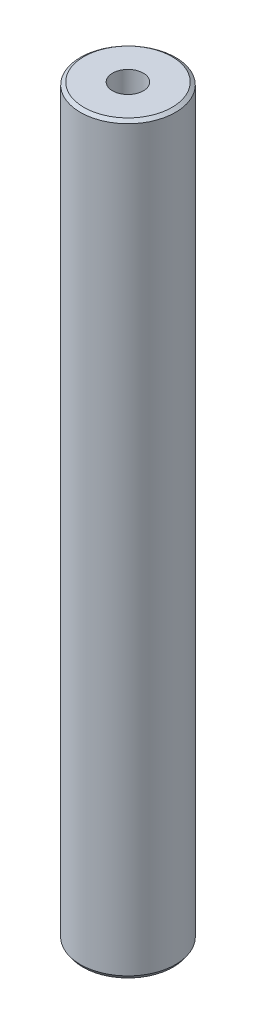
ISO-10303-21;
HEADER;
FILE_DESCRIPTION(('STEP AP214'),'2;1');
FILE_NAME('part.step','',(''),(''),'','','');
FILE_SCHEMA(('AUTOMOTIVE_DESIGN { 1 0 10303 214 1 1 1 1 }'));
ENDSEC;
DATA;
#1=APPLICATION_CONTEXT('core data for automotive mechanical design processes');
#2=APPLICATION_PROTOCOL_DEFINITION('international standard','automotive_design',2000,#1);
#3=PRODUCT_CONTEXT('',#1,'mechanical');
#4=PRODUCT('Part','Part','',(#3));
#5=PRODUCT_RELATED_PRODUCT_CATEGORY('part','',(#4));
#6=PRODUCT_DEFINITION_FORMATION('','',#4);
#7=PRODUCT_DEFINITION_CONTEXT('part definition',#1,'design');
#8=PRODUCT_DEFINITION('design','',#6,#7);
#9=PRODUCT_DEFINITION_SHAPE('','',#8);
#10=(LENGTH_UNIT() NAMED_UNIT(*) SI_UNIT(.MILLI.,.METRE.));
#11=(NAMED_UNIT(*) PLANE_ANGLE_UNIT() SI_UNIT($,.RADIAN.));
#12=(NAMED_UNIT(*) SI_UNIT($,.STERADIAN.) SOLID_ANGLE_UNIT());
#13=UNCERTAINTY_MEASURE_WITH_UNIT(LENGTH_MEASURE(1.E-05),#10,'distance_accuracy_value','');
#14=(GEOMETRIC_REPRESENTATION_CONTEXT(3) GLOBAL_UNCERTAINTY_ASSIGNED_CONTEXT((#13)) GLOBAL_UNIT_ASSIGNED_CONTEXT((#10,
#11,#12)) REPRESENTATION_CONTEXT('',''));
#15=CARTESIAN_POINT('',(0.,0.,0.));
#16=DIRECTION('',(0.,0.,1.));
#17=DIRECTION('',(1.,0.,0.));
#18=AXIS2_PLACEMENT_3D('',#15,#16,#17);
#19=CARTESIAN_POINT('',(0.,546.982576239871,0.));
#20=DIRECTION('',(0.,-1.,0.));
#21=DIRECTION('',(0.,0.,-1.));
#22=AXIS2_PLACEMENT_3D('',#19,#20,#21);
#23=CYLINDRICAL_SURFACE('',#22,35.);
#24=CARTESIAN_POINT('',(0.,545.144864558155,0.));
#25=DIRECTION('',(0.,1.,0.));
#26=DIRECTION('',(0.,0.,1.));
#27=AXIS2_PLACEMENT_3D('',#24,#25,#26);
#28=CIRCLE('',#27,35.);
#29=CARTESIAN_POINT('',(0.,545.144864558155,35.));
#30=VERTEX_POINT('',#29);
#31=EDGE_CURVE('E50',#30,#30,#28,.F.);
#32=ORIENTED_EDGE('',*,*,#31,.T.);
#33=EDGE_LOOP('',(#32));
#34=FACE_BOUND('',#33,.T.);
#35=CARTESIAN_POINT('',(0.,2.62993611991058,0.));
#36=DIRECTION('',(0.,1.,0.));
#37=DIRECTION('',(0.,0.,1.));
#38=AXIS2_PLACEMENT_3D('',#35,#36,#37);
#39=CIRCLE('',#38,35.);
#40=CARTESIAN_POINT('',(0.,2.62993611991058,35.));
#41=VERTEX_POINT('',#40);
#42=EDGE_CURVE('E51',#41,#41,#39,.T.);
#43=ORIENTED_EDGE('',*,*,#42,.T.);
#44=EDGE_LOOP('',(#43));
#45=FACE_BOUND('',#44,.T.);
#46=ADVANCED_FACE('F39',(#34,#45),#23,.T.);
#47=CARTESIAN_POINT('',(0.,546.982576239871,0.));
#48=DIRECTION('',(0.,1.,0.));
#49=DIRECTION('',(0.,0.,1.));
#50=AXIS2_PLACEMENT_3D('',#47,#48,#49);
#51=PLANE('',#50);
#52=CARTESIAN_POINT('',(0.,546.982576239871,0.));
#53=DIRECTION('',(0.,1.,0.));
#54=DIRECTION('',(0.,0.,1.));
#55=AXIS2_PLACEMENT_3D('',#52,#53,#54);
#56=CIRCLE('',#55,32.3700638800896);
#57=CARTESIAN_POINT('',(0.,546.982576239871,32.3700638800896));
#58=VERTEX_POINT('',#57);
#59=EDGE_CURVE('E54',#58,#58,#56,.T.);
#60=ORIENTED_EDGE('',*,*,#59,.T.);
#61=EDGE_LOOP('',(#60));
#62=FACE_BOUND('',#61,.T.);
#63=CARTESIAN_POINT('',(0.,546.982576239871,0.));
#64=DIRECTION('',(0.,1.,0.));
#65=DIRECTION('',(0.,0.,1.));
#66=AXIS2_PLACEMENT_3D('',#63,#64,#65);
#67=CIRCLE('',#66,11.3220997739682);
#68=CARTESIAN_POINT('',(0.,546.982576239871,11.3220997739682));
#69=VERTEX_POINT('',#68);
#70=EDGE_CURVE('E58',#69,#69,#67,.T.);
#71=ORIENTED_EDGE('',*,*,#70,.F.);
#72=EDGE_LOOP('',(#71));
#73=FACE_BOUND('',#72,.T.);
#74=ADVANCED_FACE('F69',(#62,#73),#51,.T.);
#75=CARTESIAN_POINT('',(0.,0.,0.));
#76=DIRECTION('',(0.,1.,0.));
#77=DIRECTION('',(0.,0.,1.));
#78=AXIS2_PLACEMENT_3D('',#75,#76,#77);
#79=PLANE('',#78);
#80=CARTESIAN_POINT('',(0.,0.,0.));
#81=DIRECTION('',(0.,1.,0.));
#82=DIRECTION('',(0.,0.,1.));
#83=AXIS2_PLACEMENT_3D('',#80,#81,#82);
#84=CIRCLE('',#83,33.162288318284);
#85=CARTESIAN_POINT('',(0.,0.,33.162288318284));
#86=VERTEX_POINT('',#85);
#87=EDGE_CURVE('E10',#86,#86,#84,.F.);
#88=ORIENTED_EDGE('',*,*,#87,.T.);
#89=EDGE_LOOP('',(#88));
#90=FACE_BOUND('',#89,.T.);
#91=CARTESIAN_POINT('',(0.,0.,0.));
#92=DIRECTION('',(0.,1.,0.));
#93=DIRECTION('',(0.,0.,1.));
#94=AXIS2_PLACEMENT_3D('',#91,#92,#93);
#95=CIRCLE('',#94,11.3220997739682);
#96=CARTESIAN_POINT('',(0.,0.,11.3220997739682));
#97=VERTEX_POINT('',#96);
#98=EDGE_CURVE('E63',#97,#97,#95,.T.);
#99=ORIENTED_EDGE('',*,*,#98,.T.);
#100=EDGE_LOOP('',(#99));
#101=FACE_BOUND('',#100,.T.);
#102=ADVANCED_FACE('F75',(#90,#101),#79,.F.);
#103=CARTESIAN_POINT('',(0.,546.982576239871,0.));
#104=DIRECTION('',(0.,-1.,0.));
#105=DIRECTION('',(0.,0.,-1.));
#106=AXIS2_PLACEMENT_3D('',#103,#104,#105);
#107=CYLINDRICAL_SURFACE('',#106,11.3220997739682);
#108=ORIENTED_EDGE('',*,*,#70,.T.);
#109=EDGE_LOOP('',(#108));
#110=FACE_BOUND('',#109,.T.);
#111=ORIENTED_EDGE('',*,*,#98,.F.);
#112=EDGE_LOOP('',(#111));
#113=FACE_BOUND('',#112,.T.);
#114=ADVANCED_FACE('F70',(#110,#113),#107,.F.);
#115=CARTESIAN_POINT('',(0.,546.982576239871,0.));
#116=DIRECTION('',(0.,-1.,0.));
#117=DIRECTION('',(0.,0.,-1.));
#118=AXIS2_PLACEMENT_3D('',#115,#116,#117);
#119=CONICAL_SURFACE('',#118,32.3700638800896,0.960898586258302);
#120=ORIENTED_EDGE('',*,*,#31,.F.);
#121=EDGE_LOOP('',(#120));
#122=FACE_BOUND('',#121,.T.);
#123=ORIENTED_EDGE('',*,*,#59,.F.);
#124=EDGE_LOOP('',(#123));
#125=FACE_BOUND('',#124,.T.);
#126=ADVANCED_FACE('F81',(#122,#125),#119,.T.);
#127=CARTESIAN_POINT('',(0.,2.62993611991058,0.));
#128=DIRECTION('',(0.,1.,0.));
#129=DIRECTION('',(0.,0.,1.));
#130=AXIS2_PLACEMENT_3D('',#127,#128,#129);
#131=CONICAL_SURFACE('',#130,35.,0.60989774053658);
#132=ORIENTED_EDGE('',*,*,#87,.F.);
#133=EDGE_LOOP('',(#132));
#134=FACE_BOUND('',#133,.T.);
#135=ORIENTED_EDGE('',*,*,#42,.F.);
#136=EDGE_LOOP('',(#135));
#137=FACE_BOUND('',#136,.T.);
#138=ADVANCED_FACE('F45',(#134,#137),#131,.T.);
#139=CLOSED_SHELL('',(#46,#74,#102,#114,#126,#138));
#140=MANIFOLD_SOLID_BREP('B2',#139);
#141=ADVANCED_BREP_SHAPE_REPRESENTATION('',(#18,#140),#14);
#142=SHAPE_DEFINITION_REPRESENTATION(#9,#141);
ENDSEC;
END-ISO-10303-21;
